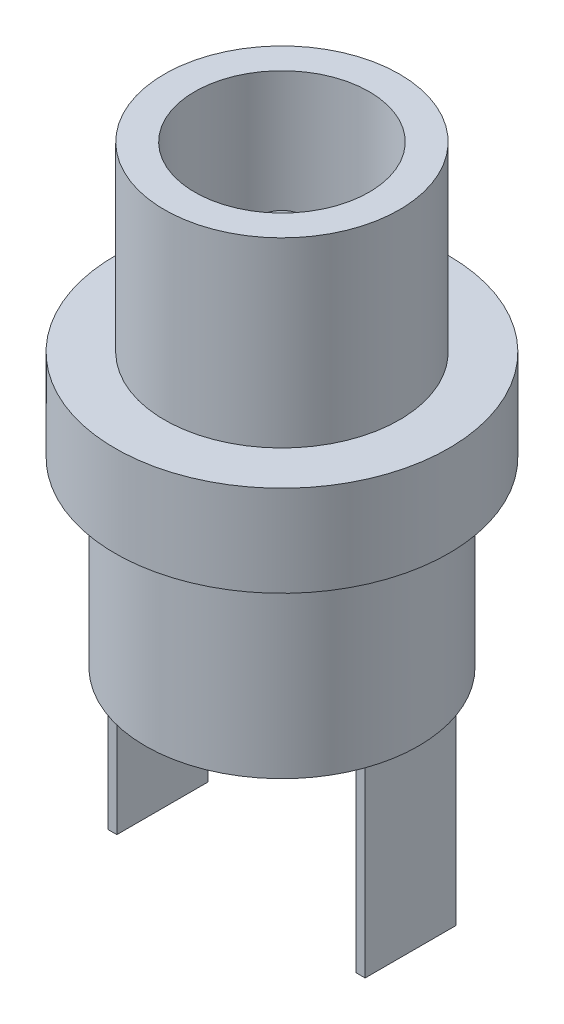
ISO-10303-21;
HEADER;
FILE_DESCRIPTION(('STEP AP214'),'2;1');
FILE_NAME('part.step','',(''),(''),'','','');
FILE_SCHEMA(('AUTOMOTIVE_DESIGN { 1 0 10303 214 1 1 1 1 }'));
ENDSEC;
DATA;
#1=APPLICATION_CONTEXT('core data for automotive mechanical design processes');
#2=APPLICATION_PROTOCOL_DEFINITION('international standard','automotive_design',2000,#1);
#3=PRODUCT_CONTEXT('',#1,'mechanical');
#4=PRODUCT('Part','Part','',(#3));
#5=PRODUCT_RELATED_PRODUCT_CATEGORY('part','',(#4));
#6=PRODUCT_DEFINITION_FORMATION('','',#4);
#7=PRODUCT_DEFINITION_CONTEXT('part definition',#1,'design');
#8=PRODUCT_DEFINITION('design','',#6,#7);
#9=PRODUCT_DEFINITION_SHAPE('','',#8);
#10=(LENGTH_UNIT() NAMED_UNIT(*) SI_UNIT(.MILLI.,.METRE.));
#11=(NAMED_UNIT(*) PLANE_ANGLE_UNIT() SI_UNIT($,.RADIAN.));
#12=(NAMED_UNIT(*) SI_UNIT($,.STERADIAN.) SOLID_ANGLE_UNIT());
#13=UNCERTAINTY_MEASURE_WITH_UNIT(LENGTH_MEASURE(1.E-05),#10,'distance_accuracy_value','');
#14=(GEOMETRIC_REPRESENTATION_CONTEXT(3) GLOBAL_UNCERTAINTY_ASSIGNED_CONTEXT((#13)) GLOBAL_UNIT_ASSIGNED_CONTEXT((#10,
#11,#12)) REPRESENTATION_CONTEXT('',''));
#15=CARTESIAN_POINT('',(0.,0.,0.));
#16=DIRECTION('',(0.,0.,1.));
#17=DIRECTION('',(1.,0.,0.));
#18=AXIS2_PLACEMENT_3D('',#15,#16,#17);
#19=CARTESIAN_POINT('',(-4.5,-15.,0.));
#20=DIRECTION('',(0.,1.,0.));
#21=DIRECTION('',(0.,0.,1.));
#22=AXIS2_PLACEMENT_3D('',#19,#20,#21);
#23=PLANE('',#22);
#24=DIRECTION('',(0.,0.,1.));
#25=VECTOR('',#24,1.);
#26=CARTESIAN_POINT('',(1.5,-15.,-3.94264068711928));
#27=LINE('',#26,#25);
#28=CARTESIAN_POINT('',(1.5,-15.,-4.24264068711928));
#29=VERTEX_POINT('',#28);
#30=CARTESIAN_POINT('',(1.5,-15.,-3.94264068711928));
#31=VERTEX_POINT('',#30);
#32=EDGE_CURVE('E178',#29,#31,#27,.T.);
#33=ORIENTED_EDGE('',*,*,#32,.F.);
#34=CARTESIAN_POINT('',(0.,-15.,0.));
#35=DIRECTION('',(0.,-1.,0.));
#36=DIRECTION('',(0.,0.,-1.));
#37=AXIS2_PLACEMENT_3D('',#34,#35,#36);
#38=CIRCLE('',#37,4.5);
#39=CARTESIAN_POINT('',(4.24264068711928,-15.,-1.5));
#40=VERTEX_POINT('',#39);
#41=EDGE_CURVE('E295',#29,#40,#38,.T.);
#42=ORIENTED_EDGE('',*,*,#41,.T.);
#43=DIRECTION('',(1.,0.,0.));
#44=VECTOR('',#43,1.);
#45=CARTESIAN_POINT('',(3.94264068711928,-15.,-1.5));
#46=LINE('',#45,#44);
#47=CARTESIAN_POINT('',(3.94264068711928,-15.,-1.5));
#48=VERTEX_POINT('',#47);
#49=EDGE_CURVE('E184',#48,#40,#46,.T.);
#50=ORIENTED_EDGE('',*,*,#49,.F.);
#51=DIRECTION('',(0.,0.,-1.));
#52=VECTOR('',#51,1.);
#53=CARTESIAN_POINT('',(3.94264068711928,-15.,1.5));
#54=LINE('',#53,#52);
#55=CARTESIAN_POINT('',(3.94264068711928,-15.,1.5));
#56=VERTEX_POINT('',#55);
#57=EDGE_CURVE('E180',#56,#48,#54,.T.);
#58=ORIENTED_EDGE('',*,*,#57,.F.);
#59=DIRECTION('',(-1.,0.,0.));
#60=VECTOR('',#59,1.);
#61=CARTESIAN_POINT('',(3.94264068711928,-15.,1.5));
#62=LINE('',#61,#60);
#63=CARTESIAN_POINT('',(4.24264068711928,-15.,1.5));
#64=VERTEX_POINT('',#63);
#65=EDGE_CURVE('E196',#64,#56,#62,.T.);
#66=ORIENTED_EDGE('',*,*,#65,.F.);
#67=CARTESIAN_POINT('',(-4.24264068711928,-15.,1.5));
#68=VERTEX_POINT('',#67);
#69=EDGE_CURVE('E288',#64,#68,#38,.T.);
#70=ORIENTED_EDGE('',*,*,#69,.T.);
#71=DIRECTION('',(-1.,0.,0.));
#72=VECTOR('',#71,1.);
#73=CARTESIAN_POINT('',(-4.24264068711928,-15.,1.5));
#74=LINE('',#73,#72);
#75=CARTESIAN_POINT('',(-3.94264068711928,-15.,1.5));
#76=VERTEX_POINT('',#75);
#77=EDGE_CURVE('E237',#76,#68,#74,.T.);
#78=ORIENTED_EDGE('',*,*,#77,.F.);
#79=DIRECTION('',(0.,0.,1.));
#80=VECTOR('',#79,1.);
#81=CARTESIAN_POINT('',(-3.94264068711928,-15.,1.5));
#82=LINE('',#81,#80);
#83=CARTESIAN_POINT('',(-3.94264068711928,-15.,-1.5));
#84=VERTEX_POINT('',#83);
#85=EDGE_CURVE('E254',#84,#76,#82,.T.);
#86=ORIENTED_EDGE('',*,*,#85,.F.);
#87=DIRECTION('',(1.,0.,0.));
#88=VECTOR('',#87,1.);
#89=CARTESIAN_POINT('',(-4.24264068711928,-15.,-1.5));
#90=LINE('',#89,#88);
#91=CARTESIAN_POINT('',(-4.24264068711928,-15.,-1.5));
#92=VERTEX_POINT('',#91);
#93=EDGE_CURVE('E250',#92,#84,#90,.T.);
#94=ORIENTED_EDGE('',*,*,#93,.F.);
#95=CARTESIAN_POINT('',(-1.5,-15.,-4.24264068711928));
#96=VERTEX_POINT('',#95);
#97=EDGE_CURVE('E294',#92,#96,#38,.T.);
#98=ORIENTED_EDGE('',*,*,#97,.T.);
#99=DIRECTION('',(0.,0.,-1.));
#100=VECTOR('',#99,1.);
#101=CARTESIAN_POINT('',(-1.5,-15.,-3.94264068711928));
#102=LINE('',#101,#100);
#103=CARTESIAN_POINT('',(-1.5,-15.,-3.94264068711928));
#104=VERTEX_POINT('',#103);
#105=EDGE_CURVE('E66',#104,#96,#102,.T.);
#106=ORIENTED_EDGE('',*,*,#105,.F.);
#107=DIRECTION('',(-1.,0.,0.));
#108=VECTOR('',#107,1.);
#109=CARTESIAN_POINT('',(1.5,-15.,-3.94264068711928));
#110=LINE('',#109,#108);
#111=EDGE_CURVE('E60',#31,#104,#110,.T.);
#112=ORIENTED_EDGE('',*,*,#111,.F.);
#113=EDGE_LOOP('',(#33,#42,#50,#58,#66,#70,#78,#86,#94,#98,#106,#112));
#114=FACE_BOUND('',#113,.T.);
#115=ADVANCED_FACE('F41',(#114),#23,.F.);
#116=DIRECTION('',(1.,0.,0.));
#117=VECTOR('',#116,1.);
#118=CARTESIAN_POINT('',(1.5,-15.,-4.24264068711928));
#119=LINE('',#118,#117);
#120=EDGE_CURVE('E175',#96,#29,#119,.T.);
#121=ORIENTED_EDGE('',*,*,#120,.F.);
#122=EDGE_CURVE('E643',#96,#29,#38,.T.);
#123=ORIENTED_EDGE('',*,*,#122,.T.);
#124=EDGE_LOOP('',(#121,#123));
#125=FACE_BOUND('',#124,.T.);
#126=ADVANCED_FACE('F330',(#125),#23,.F.);
#127=DIRECTION('',(0.,0.,1.));
#128=VECTOR('',#127,1.);
#129=CARTESIAN_POINT('',(4.24264068711928,-15.,1.5));
#130=LINE('',#129,#128);
#131=EDGE_CURVE('E209',#40,#64,#130,.T.);
#132=ORIENTED_EDGE('',*,*,#131,.F.);
#133=EDGE_CURVE('E644',#40,#64,#38,.T.);
#134=ORIENTED_EDGE('',*,*,#133,.T.);
#135=EDGE_LOOP('',(#132,#134));
#136=FACE_BOUND('',#135,.T.);
#137=ADVANCED_FACE('F336',(#136),#23,.F.);
#138=DIRECTION('',(0.,0.,-1.));
#139=VECTOR('',#138,1.);
#140=CARTESIAN_POINT('',(-4.24264068711928,-15.,1.5));
#141=LINE('',#140,#139);
#142=EDGE_CURVE('E231',#68,#92,#141,.T.);
#143=ORIENTED_EDGE('',*,*,#142,.F.);
#144=EDGE_CURVE('E289',#68,#92,#38,.T.);
#145=ORIENTED_EDGE('',*,*,#144,.T.);
#146=EDGE_LOOP('',(#143,#145));
#147=FACE_BOUND('',#146,.T.);
#148=ADVANCED_FACE('F332',(#147),#23,.F.);
#149=CARTESIAN_POINT('',(-2.875,0.,0.));
#150=DIRECTION('',(0.,-1.,0.));
#151=DIRECTION('',(0.,0.,-1.));
#152=AXIS2_PLACEMENT_3D('',#149,#150,#151);
#153=PLANE('',#152);
#154=CARTESIAN_POINT('',(0.,0.,0.));
#155=DIRECTION('',(0.,-1.,0.));
#156=DIRECTION('',(0.,0.,-1.));
#157=AXIS2_PLACEMENT_3D('',#154,#155,#156);
#158=CIRCLE('',#157,3.875);
#159=CARTESIAN_POINT('',(0.,0.,-3.875));
#160=VERTEX_POINT('',#159);
#161=EDGE_CURVE('E311',#160,#160,#158,.T.);
#162=ORIENTED_EDGE('',*,*,#161,.F.);
#163=EDGE_LOOP('',(#162));
#164=FACE_BOUND('',#163,.T.);
#165=CARTESIAN_POINT('',(0.,0.,0.));
#166=DIRECTION('',(0.,-1.,0.));
#167=DIRECTION('',(0.,0.,-1.));
#168=AXIS2_PLACEMENT_3D('',#165,#166,#167);
#169=CIRCLE('',#168,2.875);
#170=CARTESIAN_POINT('',(0.,0.,-2.875));
#171=VERTEX_POINT('',#170);
#172=EDGE_CURVE('E276',#171,#171,#169,.T.);
#173=ORIENTED_EDGE('',*,*,#172,.T.);
#174=EDGE_LOOP('',(#173));
#175=FACE_BOUND('',#174,.T.);
#176=ADVANCED_FACE('F341',(#164,#175),#153,.F.);
#177=CARTESIAN_POINT('',(0.,-15.,0.));
#178=DIRECTION('',(0.,-1.,0.));
#179=DIRECTION('',(0.,0.,-1.));
#180=AXIS2_PLACEMENT_3D('',#177,#178,#179);
#181=CYLINDRICAL_SURFACE('',#180,3.875);
#182=CARTESIAN_POINT('',(0.,-6.,0.));
#183=DIRECTION('',(0.,-1.,0.));
#184=DIRECTION('',(0.,0.,-1.));
#185=AXIS2_PLACEMENT_3D('',#182,#183,#184);
#186=CIRCLE('',#185,3.875);
#187=CARTESIAN_POINT('',(0.,-6.,-3.875));
#188=VERTEX_POINT('',#187);
#189=EDGE_CURVE('E307',#188,#188,#186,.T.);
#190=ORIENTED_EDGE('',*,*,#189,.F.);
#191=EDGE_LOOP('',(#190));
#192=FACE_BOUND('',#191,.T.);
#193=ORIENTED_EDGE('',*,*,#161,.T.);
#194=EDGE_LOOP('',(#193));
#195=FACE_BOUND('',#194,.T.);
#196=ADVANCED_FACE('F347',(#192,#195),#181,.T.);
#197=CARTESIAN_POINT('',(-3.875,-6.,0.));
#198=DIRECTION('',(0.,-1.,0.));
#199=DIRECTION('',(0.,0.,-1.));
#200=AXIS2_PLACEMENT_3D('',#197,#198,#199);
#201=PLANE('',#200);
#202=CARTESIAN_POINT('',(0.,-6.,0.));
#203=DIRECTION('',(0.,-1.,0.));
#204=DIRECTION('',(0.,0.,-1.));
#205=AXIS2_PLACEMENT_3D('',#202,#203,#204);
#206=CIRCLE('',#205,5.5);
#207=CARTESIAN_POINT('',(0.,-6.,-5.5));
#208=VERTEX_POINT('',#207);
#209=EDGE_CURVE('E303',#208,#208,#206,.T.);
#210=ORIENTED_EDGE('',*,*,#209,.F.);
#211=EDGE_LOOP('',(#210));
#212=FACE_BOUND('',#211,.T.);
#213=ORIENTED_EDGE('',*,*,#189,.T.);
#214=EDGE_LOOP('',(#213));
#215=FACE_BOUND('',#214,.T.);
#216=ADVANCED_FACE('F412',(#212,#215),#201,.F.);
#217=CARTESIAN_POINT('',(0.,-15.,0.));
#218=DIRECTION('',(0.,-1.,0.));
#219=DIRECTION('',(0.,0.,-1.));
#220=AXIS2_PLACEMENT_3D('',#217,#218,#219);
#221=CYLINDRICAL_SURFACE('',#220,5.5);
#222=CARTESIAN_POINT('',(0.,-9.,0.));
#223=DIRECTION('',(0.,-1.,0.));
#224=DIRECTION('',(0.,0.,-1.));
#225=AXIS2_PLACEMENT_3D('',#222,#223,#224);
#226=CIRCLE('',#225,5.5);
#227=CARTESIAN_POINT('',(0.,-9.,-5.5));
#228=VERTEX_POINT('',#227);
#229=EDGE_CURVE('E299',#228,#228,#226,.T.);
#230=ORIENTED_EDGE('',*,*,#229,.F.);
#231=EDGE_LOOP('',(#230));
#232=FACE_BOUND('',#231,.T.);
#233=ORIENTED_EDGE('',*,*,#209,.T.);
#234=EDGE_LOOP('',(#233));
#235=FACE_BOUND('',#234,.T.);
#236=ADVANCED_FACE('F406',(#232,#235),#221,.T.);
#237=CARTESIAN_POINT('',(-5.5,-9.,0.));
#238=DIRECTION('',(0.,1.,0.));
#239=DIRECTION('',(0.,0.,1.));
#240=AXIS2_PLACEMENT_3D('',#237,#238,#239);
#241=PLANE('',#240);
#242=CARTESIAN_POINT('',(0.,-9.,0.));
#243=DIRECTION('',(0.,-1.,0.));
#244=DIRECTION('',(0.,0.,-1.));
#245=AXIS2_PLACEMENT_3D('',#242,#243,#244);
#246=CIRCLE('',#245,4.5);
#247=CARTESIAN_POINT('',(0.,-9.,-4.5));
#248=VERTEX_POINT('',#247);
#249=EDGE_CURVE('E293',#248,#248,#246,.T.);
#250=ORIENTED_EDGE('',*,*,#249,.F.);
#251=EDGE_LOOP('',(#250));
#252=FACE_BOUND('',#251,.T.);
#253=ORIENTED_EDGE('',*,*,#229,.T.);
#254=EDGE_LOOP('',(#253));
#255=FACE_BOUND('',#254,.T.);
#256=ADVANCED_FACE('F402',(#252,#255),#241,.F.);
#257=CARTESIAN_POINT('',(0.,-15.,0.));
#258=DIRECTION('',(0.,-1.,0.));
#259=DIRECTION('',(0.,0.,-1.));
#260=AXIS2_PLACEMENT_3D('',#257,#258,#259);
#261=CYLINDRICAL_SURFACE('',#260,4.5);
#262=ORIENTED_EDGE('',*,*,#144,.F.);
#263=ORIENTED_EDGE('',*,*,#69,.F.);
#264=ORIENTED_EDGE('',*,*,#133,.F.);
#265=ORIENTED_EDGE('',*,*,#41,.F.);
#266=ORIENTED_EDGE('',*,*,#122,.F.);
#267=ORIENTED_EDGE('',*,*,#97,.F.);
#268=EDGE_LOOP('',(#262,#263,#264,#265,#266,#267));
#269=FACE_BOUND('',#268,.T.);
#270=ORIENTED_EDGE('',*,*,#249,.T.);
#271=EDGE_LOOP('',(#270));
#272=FACE_BOUND('',#271,.T.);
#273=ADVANCED_FACE('F357',(#269,#272),#261,.T.);
#274=CARTESIAN_POINT('',(0.,-2.3,0.));
#275=DIRECTION('',(0.,-1.,0.));
#276=DIRECTION('',(0.,0.,-1.));
#277=AXIS2_PLACEMENT_3D('',#274,#275,#276);
#278=PLANE('',#277);
#279=CARTESIAN_POINT('',(0.,-2.3,0.));
#280=DIRECTION('',(0.,-1.,0.));
#281=DIRECTION('',(0.,0.,-1.));
#282=AXIS2_PLACEMENT_3D('',#279,#280,#281);
#283=CIRCLE('',#282,0.25);
#284=CARTESIAN_POINT('',(0.,-2.3,-0.25));
#285=VERTEX_POINT('',#284);
#286=EDGE_CURVE('E11',#285,#285,#283,.F.);
#287=ORIENTED_EDGE('',*,*,#286,.T.);
#288=EDGE_LOOP('',(#287));
#289=FACE_BOUND('',#288,.T.);
#290=ADVANCED_FACE('F396',(#289),#278,.F.);
#291=CARTESIAN_POINT('',(0.,-15.,0.));
#292=DIRECTION('',(0.,-1.,0.));
#293=DIRECTION('',(0.,0.,-1.));
#294=AXIS2_PLACEMENT_3D('',#291,#292,#293);
#295=CYLINDRICAL_SURFACE('',#294,1.);
#296=CARTESIAN_POINT('',(0.,-3.05,0.));
#297=DIRECTION('',(0.,-1.,0.));
#298=DIRECTION('',(0.,0.,-1.));
#299=AXIS2_PLACEMENT_3D('',#296,#297,#298);
#300=CIRCLE('',#299,1.);
#301=CARTESIAN_POINT('',(0.,-3.05,-1.));
#302=VERTEX_POINT('',#301);
#303=EDGE_CURVE('E50',#302,#302,#300,.T.);
#304=ORIENTED_EDGE('',*,*,#303,.T.);
#305=EDGE_LOOP('',(#304));
#306=FACE_BOUND('',#305,.T.);
#307=CARTESIAN_POINT('',(0.,-10.,0.));
#308=DIRECTION('',(0.,-1.,0.));
#309=DIRECTION('',(0.,0.,-1.));
#310=AXIS2_PLACEMENT_3D('',#307,#308,#309);
#311=CIRCLE('',#310,0.999999999999999);
#312=CARTESIAN_POINT('',(0.,-10.,-0.999999999999999));
#313=VERTEX_POINT('',#312);
#314=EDGE_CURVE('E284',#313,#313,#311,.T.);
#315=ORIENTED_EDGE('',*,*,#314,.F.);
#316=EDGE_LOOP('',(#315));
#317=FACE_BOUND('',#316,.T.);
#318=ADVANCED_FACE('F318',(#306,#317),#295,.T.);
#319=CARTESIAN_POINT('',(-0.999999999999999,-10.,0.));
#320=DIRECTION('',(0.,-1.,0.));
#321=DIRECTION('',(0.,0.,-1.));
#322=AXIS2_PLACEMENT_3D('',#319,#320,#321);
#323=PLANE('',#322);
#324=CARTESIAN_POINT('',(0.,-10.,0.));
#325=DIRECTION('',(0.,-1.,0.));
#326=DIRECTION('',(0.,0.,-1.));
#327=AXIS2_PLACEMENT_3D('',#324,#325,#326);
#328=CIRCLE('',#327,2.875);
#329=CARTESIAN_POINT('',(0.,-10.,-2.875));
#330=VERTEX_POINT('',#329);
#331=EDGE_CURVE('E280',#330,#330,#328,.T.);
#332=ORIENTED_EDGE('',*,*,#331,.F.);
#333=EDGE_LOOP('',(#332));
#334=FACE_BOUND('',#333,.T.);
#335=ORIENTED_EDGE('',*,*,#314,.T.);
#336=EDGE_LOOP('',(#335));
#337=FACE_BOUND('',#336,.T.);
#338=ADVANCED_FACE('F390',(#334,#337),#323,.F.);
#339=CARTESIAN_POINT('',(0.,-15.,0.));
#340=DIRECTION('',(0.,-1.,0.));
#341=DIRECTION('',(0.,0.,-1.));
#342=AXIS2_PLACEMENT_3D('',#339,#340,#341);
#343=CYLINDRICAL_SURFACE('',#342,2.875);
#344=ORIENTED_EDGE('',*,*,#172,.F.);
#345=EDGE_LOOP('',(#344));
#346=FACE_BOUND('',#345,.T.);
#347=ORIENTED_EDGE('',*,*,#331,.T.);
#348=EDGE_LOOP('',(#347));
#349=FACE_BOUND('',#348,.T.);
#350=ADVANCED_FACE('F384',(#346,#349),#343,.F.);
#351=CARTESIAN_POINT('',(-4.24264068711928,-21.,1.5));
#352=DIRECTION('',(1.,0.,0.));
#353=DIRECTION('',(0.,0.,-1.));
#354=AXIS2_PLACEMENT_3D('',#351,#352,#353);
#355=PLANE('',#354);
#356=ORIENTED_EDGE('',*,*,#142,.T.);
#357=DIRECTION('',(0.,1.,0.));
#358=VECTOR('',#357,1.);
#359=CARTESIAN_POINT('',(-4.24264068711928,-21.,-1.5));
#360=LINE('',#359,#358);
#361=CARTESIAN_POINT('',(-4.24264068711928,-21.,-1.5));
#362=VERTEX_POINT('',#361);
#363=EDGE_CURVE('E272',#362,#92,#360,.T.);
#364=ORIENTED_EDGE('',*,*,#363,.F.);
#365=DIRECTION('',(0.,0.,-1.));
#366=VECTOR('',#365,1.);
#367=CARTESIAN_POINT('',(-4.24264068711928,-21.,1.5));
#368=LINE('',#367,#366);
#369=CARTESIAN_POINT('',(-4.24264068711928,-21.,1.5));
#370=VERTEX_POINT('',#369);
#371=EDGE_CURVE('E232',#370,#362,#368,.T.);
#372=ORIENTED_EDGE('',*,*,#371,.F.);
#373=DIRECTION('',(0.,1.,0.));
#374=VECTOR('',#373,1.);
#375=CARTESIAN_POINT('',(-4.24264068711928,-21.,1.5));
#376=LINE('',#375,#374);
#377=EDGE_CURVE('E246',#370,#68,#376,.T.);
#378=ORIENTED_EDGE('',*,*,#377,.T.);
#379=EDGE_LOOP('',(#356,#364,#372,#378));
#380=FACE_BOUND('',#379,.T.);
#381=ADVANCED_FACE('F368',(#380),#355,.F.);
#382=CARTESIAN_POINT('',(-4.24264068711928,-21.,-1.5));
#383=DIRECTION('',(0.,0.,1.));
#384=DIRECTION('',(1.,0.,0.));
#385=AXIS2_PLACEMENT_3D('',#382,#383,#384);
#386=PLANE('',#385);
#387=ORIENTED_EDGE('',*,*,#93,.T.);
#388=DIRECTION('',(0.,1.,0.));
#389=VECTOR('',#388,1.);
#390=CARTESIAN_POINT('',(-3.94264068711928,-21.,-1.5));
#391=LINE('',#390,#389);
#392=CARTESIAN_POINT('',(-3.94264068711928,-21.,-1.5));
#393=VERTEX_POINT('',#392);
#394=EDGE_CURVE('E268',#393,#84,#391,.T.);
#395=ORIENTED_EDGE('',*,*,#394,.F.);
#396=DIRECTION('',(1.,0.,0.));
#397=VECTOR('',#396,1.);
#398=CARTESIAN_POINT('',(-4.24264068711928,-21.,-1.5));
#399=LINE('',#398,#397);
#400=EDGE_CURVE('E236',#362,#393,#399,.T.);
#401=ORIENTED_EDGE('',*,*,#400,.F.);
#402=ORIENTED_EDGE('',*,*,#363,.T.);
#403=EDGE_LOOP('',(#387,#395,#401,#402));
#404=FACE_BOUND('',#403,.T.);
#405=ADVANCED_FACE('F376',(#404),#386,.F.);
#406=CARTESIAN_POINT('',(-3.94264068711928,-21.,1.5));
#407=DIRECTION('',(-1.,0.,0.));
#408=DIRECTION('',(0.,0.,1.));
#409=AXIS2_PLACEMENT_3D('',#406,#407,#408);
#410=PLANE('',#409);
#411=ORIENTED_EDGE('',*,*,#85,.T.);
#412=DIRECTION('',(0.,1.,0.));
#413=VECTOR('',#412,1.);
#414=CARTESIAN_POINT('',(-3.94264068711928,-21.,1.5));
#415=LINE('',#414,#413);
#416=CARTESIAN_POINT('',(-3.94264068711928,-21.,1.5));
#417=VERTEX_POINT('',#416);
#418=EDGE_CURVE('E264',#417,#76,#415,.T.);
#419=ORIENTED_EDGE('',*,*,#418,.F.);
#420=DIRECTION('',(0.,0.,1.));
#421=VECTOR('',#420,1.);
#422=CARTESIAN_POINT('',(-3.94264068711928,-21.,1.5));
#423=LINE('',#422,#421);
#424=EDGE_CURVE('E240',#393,#417,#423,.T.);
#425=ORIENTED_EDGE('',*,*,#424,.F.);
#426=ORIENTED_EDGE('',*,*,#394,.T.);
#427=EDGE_LOOP('',(#411,#419,#425,#426));
#428=FACE_BOUND('',#427,.T.);
#429=ADVANCED_FACE('F374',(#428),#410,.F.);
#430=CARTESIAN_POINT('',(-4.24264068711928,-21.,1.5));
#431=DIRECTION('',(0.,0.,-1.));
#432=DIRECTION('',(-1.,0.,0.));
#433=AXIS2_PLACEMENT_3D('',#430,#431,#432);
#434=PLANE('',#433);
#435=ORIENTED_EDGE('',*,*,#77,.T.);
#436=ORIENTED_EDGE('',*,*,#377,.F.);
#437=DIRECTION('',(-1.,0.,0.));
#438=VECTOR('',#437,1.);
#439=CARTESIAN_POINT('',(-4.24264068711928,-21.,1.5));
#440=LINE('',#439,#438);
#441=EDGE_CURVE('E243',#417,#370,#440,.T.);
#442=ORIENTED_EDGE('',*,*,#441,.F.);
#443=ORIENTED_EDGE('',*,*,#418,.T.);
#444=EDGE_LOOP('',(#435,#436,#442,#443));
#445=FACE_BOUND('',#444,.T.);
#446=ADVANCED_FACE('F364',(#445),#434,.F.);
#447=CARTESIAN_POINT('',(0.,-21.,0.));
#448=DIRECTION('',(0.,-1.,0.));
#449=DIRECTION('',(0.,0.,-1.));
#450=AXIS2_PLACEMENT_3D('',#447,#448,#449);
#451=PLANE('',#450);
#452=ORIENTED_EDGE('',*,*,#371,.T.);
#453=ORIENTED_EDGE('',*,*,#400,.T.);
#454=ORIENTED_EDGE('',*,*,#424,.T.);
#455=ORIENTED_EDGE('',*,*,#441,.T.);
#456=EDGE_LOOP('',(#452,#453,#454,#455));
#457=FACE_BOUND('',#456,.T.);
#458=ADVANCED_FACE('F370',(#457),#451,.T.);
#459=CARTESIAN_POINT('',(3.94264068711928,-21.,1.5));
#460=DIRECTION('',(1.,0.,0.));
#461=DIRECTION('',(0.,0.,-1.));
#462=AXIS2_PLACEMENT_3D('',#459,#460,#461);
#463=PLANE('',#462);
#464=ORIENTED_EDGE('',*,*,#57,.T.);
#465=DIRECTION('',(0.,1.,0.));
#466=VECTOR('',#465,1.);
#467=CARTESIAN_POINT('',(3.94264068711928,-21.,-1.5));
#468=LINE('',#467,#466);
#469=CARTESIAN_POINT('',(3.94264068711928,-21.,-1.5));
#470=VERTEX_POINT('',#469);
#471=EDGE_CURVE('E227',#470,#48,#468,.T.);
#472=ORIENTED_EDGE('',*,*,#471,.F.);
#473=DIRECTION('',(0.,0.,-1.));
#474=VECTOR('',#473,1.);
#475=CARTESIAN_POINT('',(3.94264068711928,-21.,1.5));
#476=LINE('',#475,#474);
#477=CARTESIAN_POINT('',(3.94264068711928,-21.,1.5));
#478=VERTEX_POINT('',#477);
#479=EDGE_CURVE('E191',#478,#470,#476,.T.);
#480=ORIENTED_EDGE('',*,*,#479,.F.);
#481=DIRECTION('',(0.,1.,0.));
#482=VECTOR('',#481,1.);
#483=CARTESIAN_POINT('',(3.94264068711928,-21.,1.5));
#484=LINE('',#483,#482);
#485=EDGE_CURVE('E204',#478,#56,#484,.T.);
#486=ORIENTED_EDGE('',*,*,#485,.T.);
#487=EDGE_LOOP('',(#464,#472,#480,#486));
#488=FACE_BOUND('',#487,.T.);
#489=ADVANCED_FACE('F489',(#488),#463,.F.);
#490=CARTESIAN_POINT('',(3.94264068711928,-21.,-1.5));
#491=DIRECTION('',(0.,0.,1.));
#492=DIRECTION('',(1.,0.,0.));
#493=AXIS2_PLACEMENT_3D('',#490,#491,#492);
#494=PLANE('',#493);
#495=ORIENTED_EDGE('',*,*,#49,.T.);
#496=DIRECTION('',(0.,1.,0.));
#497=VECTOR('',#496,1.);
#498=CARTESIAN_POINT('',(4.24264068711928,-21.,-1.5));
#499=LINE('',#498,#497);
#500=CARTESIAN_POINT('',(4.24264068711928,-21.,-1.5));
#501=VERTEX_POINT('',#500);
#502=EDGE_CURVE('E223',#501,#40,#499,.T.);
#503=ORIENTED_EDGE('',*,*,#502,.F.);
#504=DIRECTION('',(1.,0.,0.));
#505=VECTOR('',#504,1.);
#506=CARTESIAN_POINT('',(3.94264068711928,-21.,-1.5));
#507=LINE('',#506,#505);
#508=EDGE_CURVE('E195',#470,#501,#507,.T.);
#509=ORIENTED_EDGE('',*,*,#508,.F.);
#510=ORIENTED_EDGE('',*,*,#471,.T.);
#511=EDGE_LOOP('',(#495,#503,#509,#510));
#512=FACE_BOUND('',#511,.T.);
#513=ADVANCED_FACE('F498',(#512),#494,.F.);
#514=CARTESIAN_POINT('',(4.24264068711928,-21.,1.5));
#515=DIRECTION('',(-1.,0.,0.));
#516=DIRECTION('',(0.,0.,1.));
#517=AXIS2_PLACEMENT_3D('',#514,#515,#516);
#518=PLANE('',#517);
#519=ORIENTED_EDGE('',*,*,#131,.T.);
#520=DIRECTION('',(0.,1.,0.));
#521=VECTOR('',#520,1.);
#522=CARTESIAN_POINT('',(4.24264068711928,-21.,1.5));
#523=LINE('',#522,#521);
#524=CARTESIAN_POINT('',(4.24264068711928,-21.,1.5));
#525=VERTEX_POINT('',#524);
#526=EDGE_CURVE('E219',#525,#64,#523,.T.);
#527=ORIENTED_EDGE('',*,*,#526,.F.);
#528=DIRECTION('',(0.,0.,1.));
#529=VECTOR('',#528,1.);
#530=CARTESIAN_POINT('',(4.24264068711928,-21.,1.5));
#531=LINE('',#530,#529);
#532=EDGE_CURVE('E199',#501,#525,#531,.T.);
#533=ORIENTED_EDGE('',*,*,#532,.F.);
#534=ORIENTED_EDGE('',*,*,#502,.T.);
#535=EDGE_LOOP('',(#519,#527,#533,#534));
#536=FACE_BOUND('',#535,.T.);
#537=ADVANCED_FACE('F508',(#536),#518,.F.);
#538=CARTESIAN_POINT('',(3.94264068711928,-21.,1.5));
#539=DIRECTION('',(0.,0.,-1.));
#540=DIRECTION('',(-1.,0.,0.));
#541=AXIS2_PLACEMENT_3D('',#538,#539,#540);
#542=PLANE('',#541);
#543=ORIENTED_EDGE('',*,*,#65,.T.);
#544=ORIENTED_EDGE('',*,*,#485,.F.);
#545=DIRECTION('',(-1.,0.,0.));
#546=VECTOR('',#545,1.);
#547=CARTESIAN_POINT('',(3.94264068711928,-21.,1.5));
#548=LINE('',#547,#546);
#549=EDGE_CURVE('E202',#525,#478,#548,.T.);
#550=ORIENTED_EDGE('',*,*,#549,.F.);
#551=ORIENTED_EDGE('',*,*,#526,.T.);
#552=EDGE_LOOP('',(#543,#544,#550,#551));
#553=FACE_BOUND('',#552,.T.);
#554=ADVANCED_FACE('F518',(#553),#542,.F.);
#555=CARTESIAN_POINT('',(0.,-21.,0.));
#556=DIRECTION('',(0.,-1.,0.));
#557=DIRECTION('',(0.,0.,-1.));
#558=AXIS2_PLACEMENT_3D('',#555,#556,#557);
#559=PLANE('',#558);
#560=ORIENTED_EDGE('',*,*,#479,.T.);
#561=ORIENTED_EDGE('',*,*,#508,.T.);
#562=ORIENTED_EDGE('',*,*,#532,.T.);
#563=ORIENTED_EDGE('',*,*,#549,.T.);
#564=EDGE_LOOP('',(#560,#561,#562,#563));
#565=FACE_BOUND('',#564,.T.);
#566=ADVANCED_FACE('F528',(#565),#559,.T.);
#567=CARTESIAN_POINT('',(1.5,-21.,-3.94264068711928));
#568=DIRECTION('',(-1.,0.,0.));
#569=DIRECTION('',(0.,0.,1.));
#570=AXIS2_PLACEMENT_3D('',#567,#568,#569);
#571=PLANE('',#570);
#572=ORIENTED_EDGE('',*,*,#32,.T.);
#573=DIRECTION('',(0.,1.,0.));
#574=VECTOR('',#573,1.);
#575=CARTESIAN_POINT('',(1.5,-21.,-3.94264068711928));
#576=LINE('',#575,#574);
#577=CARTESIAN_POINT('',(1.5,-21.,-3.94264068711928));
#578=VERTEX_POINT('',#577);
#579=EDGE_CURVE('E157',#578,#31,#576,.T.);
#580=ORIENTED_EDGE('',*,*,#579,.F.);
#581=DIRECTION('',(0.,0.,1.));
#582=VECTOR('',#581,1.);
#583=CARTESIAN_POINT('',(1.5,-21.,-3.94264068711928));
#584=LINE('',#583,#582);
#585=CARTESIAN_POINT('',(1.5,-21.,-4.24264068711928));
#586=VERTEX_POINT('',#585);
#587=EDGE_CURVE('E165',#586,#578,#584,.T.);
#588=ORIENTED_EDGE('',*,*,#587,.F.);
#589=DIRECTION('',(0.,1.,0.));
#590=VECTOR('',#589,1.);
#591=CARTESIAN_POINT('',(1.5,-21.,-4.24264068711928));
#592=LINE('',#591,#590);
#593=EDGE_CURVE('E625',#586,#29,#592,.T.);
#594=ORIENTED_EDGE('',*,*,#593,.T.);
#595=EDGE_LOOP('',(#572,#580,#588,#594));
#596=FACE_BOUND('',#595,.T.);
#597=ADVANCED_FACE('F177',(#596),#571,.F.);
#598=CARTESIAN_POINT('',(1.5,-21.,-3.94264068711928));
#599=DIRECTION('',(0.,0.,-1.));
#600=DIRECTION('',(-1.,0.,0.));
#601=AXIS2_PLACEMENT_3D('',#598,#599,#600);
#602=PLANE('',#601);
#603=ORIENTED_EDGE('',*,*,#111,.T.);
#604=DIRECTION('',(0.,1.,0.));
#605=VECTOR('',#604,1.);
#606=CARTESIAN_POINT('',(-1.5,-21.,-3.94264068711928));
#607=LINE('',#606,#605);
#608=CARTESIAN_POINT('',(-1.5,-21.,-3.94264068711928));
#609=VERTEX_POINT('',#608);
#610=EDGE_CURVE('E160',#609,#104,#607,.T.);
#611=ORIENTED_EDGE('',*,*,#610,.F.);
#612=DIRECTION('',(-1.,0.,0.));
#613=VECTOR('',#612,1.);
#614=CARTESIAN_POINT('',(1.5,-21.,-3.94264068711928));
#615=LINE('',#614,#613);
#616=EDGE_CURVE('E153',#578,#609,#615,.T.);
#617=ORIENTED_EDGE('',*,*,#616,.F.);
#618=ORIENTED_EDGE('',*,*,#579,.T.);
#619=EDGE_LOOP('',(#603,#611,#617,#618));
#620=FACE_BOUND('',#619,.T.);
#621=ADVANCED_FACE('F155',(#620),#602,.F.);
#622=CARTESIAN_POINT('',(-1.5,-21.,-3.94264068711928));
#623=DIRECTION('',(1.,0.,0.));
#624=DIRECTION('',(0.,0.,-1.));
#625=AXIS2_PLACEMENT_3D('',#622,#623,#624);
#626=PLANE('',#625);
#627=ORIENTED_EDGE('',*,*,#105,.T.);
#628=DIRECTION('',(0.,1.,0.));
#629=VECTOR('',#628,1.);
#630=CARTESIAN_POINT('',(-1.5,-21.,-4.24264068711928));
#631=LINE('',#630,#629);
#632=CARTESIAN_POINT('',(-1.5,-21.,-4.24264068711928));
#633=VERTEX_POINT('',#632);
#634=EDGE_CURVE('E187',#633,#96,#631,.T.);
#635=ORIENTED_EDGE('',*,*,#634,.F.);
#636=DIRECTION('',(0.,0.,-1.));
#637=VECTOR('',#636,1.);
#638=CARTESIAN_POINT('',(-1.5,-21.,-3.94264068711928));
#639=LINE('',#638,#637);
#640=EDGE_CURVE('E164',#609,#633,#639,.T.);
#641=ORIENTED_EDGE('',*,*,#640,.F.);
#642=ORIENTED_EDGE('',*,*,#610,.T.);
#643=EDGE_LOOP('',(#627,#635,#641,#642));
#644=FACE_BOUND('',#643,.T.);
#645=ADVANCED_FACE('F555',(#644),#626,.F.);
#646=CARTESIAN_POINT('',(1.5,-21.,-4.24264068711928));
#647=DIRECTION('',(0.,0.,1.));
#648=DIRECTION('',(1.,0.,0.));
#649=AXIS2_PLACEMENT_3D('',#646,#647,#648);
#650=PLANE('',#649);
#651=ORIENTED_EDGE('',*,*,#120,.T.);
#652=ORIENTED_EDGE('',*,*,#593,.F.);
#653=DIRECTION('',(1.,0.,0.));
#654=VECTOR('',#653,1.);
#655=CARTESIAN_POINT('',(1.5,-21.,-4.24264068711928));
#656=LINE('',#655,#654);
#657=EDGE_CURVE('E170',#633,#586,#656,.T.);
#658=ORIENTED_EDGE('',*,*,#657,.F.);
#659=ORIENTED_EDGE('',*,*,#634,.T.);
#660=EDGE_LOOP('',(#651,#652,#658,#659));
#661=FACE_BOUND('',#660,.T.);
#662=ADVANCED_FACE('F326',(#661),#650,.F.);
#663=CARTESIAN_POINT('',(0.,-21.,0.));
#664=DIRECTION('',(0.,1.,0.));
#665=DIRECTION('',(0.,0.,1.));
#666=AXIS2_PLACEMENT_3D('',#663,#664,#665);
#667=PLANE('',#666);
#668=ORIENTED_EDGE('',*,*,#587,.T.);
#669=ORIENTED_EDGE('',*,*,#616,.T.);
#670=ORIENTED_EDGE('',*,*,#640,.T.);
#671=ORIENTED_EDGE('',*,*,#657,.T.);
#672=EDGE_LOOP('',(#668,#669,#670,#671));
#673=FACE_BOUND('',#672,.T.);
#674=ADVANCED_FACE('F168',(#673),#667,.F.);
#675=CARTESIAN_POINT('',(0.,-3.05,0.));
#676=DIRECTION('',(0.,-1.,0.));
#677=DIRECTION('',(0.,0.,-1.));
#678=AXIS2_PLACEMENT_3D('',#675,#676,#677);
#679=DEGENERATE_TOROIDAL_SURFACE('',#678,0.25,0.75,.T.);
#680=ORIENTED_EDGE('',*,*,#286,.F.);
#681=EDGE_LOOP('',(#680));
#682=FACE_BOUND('',#681,.T.);
#683=ORIENTED_EDGE('',*,*,#303,.F.);
#684=EDGE_LOOP('',(#683));
#685=FACE_BOUND('',#684,.T.);
#686=ADVANCED_FACE('F43',(#682,#685),#679,.T.);
#687=CLOSED_SHELL('',(#115,#126,#137,#148,#176,#196,#216,#236,#256,#273,#290,#318,#338,#350,
#381,#405,#429,#446,#458,#489,#513,#537,#554,#566,#597,#621,#645,#662,#674,#686));
#688=MANIFOLD_SOLID_BREP('B2',#687);
#689=ADVANCED_BREP_SHAPE_REPRESENTATION('',(#18,#688),#14);
#690=SHAPE_DEFINITION_REPRESENTATION(#9,#689);
ENDSEC;
END-ISO-10303-21;
